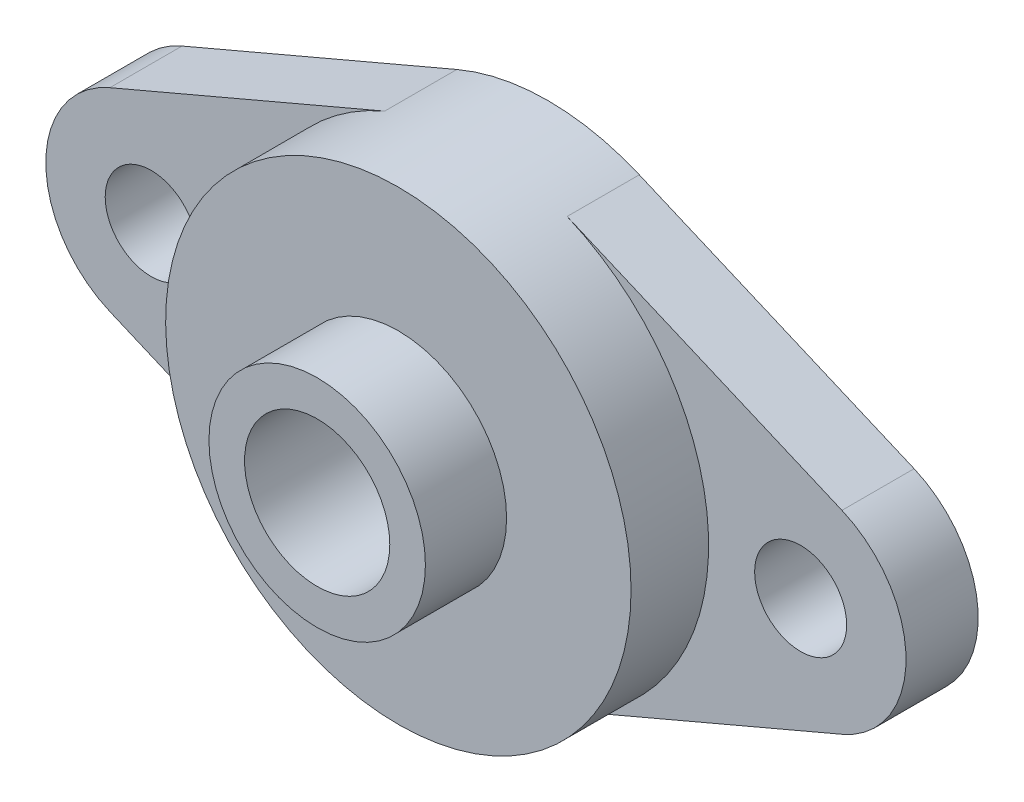
ISO-10303-21;
HEADER;
FILE_DESCRIPTION(('STEP AP214'),'2;1');
FILE_NAME('part.step','',(''),(''),'','','');
FILE_SCHEMA(('AUTOMOTIVE_DESIGN { 1 0 10303 214 1 1 1 1 }'));
ENDSEC;
DATA;
#1=APPLICATION_CONTEXT('core data for automotive mechanical design processes');
#2=APPLICATION_PROTOCOL_DEFINITION('international standard','automotive_design',2000,#1);
#3=PRODUCT_CONTEXT('',#1,'mechanical');
#4=PRODUCT('Part','Part','',(#3));
#5=PRODUCT_RELATED_PRODUCT_CATEGORY('part','',(#4));
#6=PRODUCT_DEFINITION_FORMATION('','',#4);
#7=PRODUCT_DEFINITION_CONTEXT('part definition',#1,'design');
#8=PRODUCT_DEFINITION('design','',#6,#7);
#9=PRODUCT_DEFINITION_SHAPE('','',#8);
#10=(LENGTH_UNIT() NAMED_UNIT(*) SI_UNIT(.MILLI.,.METRE.));
#11=(NAMED_UNIT(*) PLANE_ANGLE_UNIT() SI_UNIT($,.RADIAN.));
#12=(NAMED_UNIT(*) SI_UNIT($,.STERADIAN.) SOLID_ANGLE_UNIT());
#13=UNCERTAINTY_MEASURE_WITH_UNIT(LENGTH_MEASURE(1.E-05),#10,'distance_accuracy_value','');
#14=(GEOMETRIC_REPRESENTATION_CONTEXT(3) GLOBAL_UNCERTAINTY_ASSIGNED_CONTEXT((#13)) GLOBAL_UNIT_ASSIGNED_CONTEXT((#10,
#11,#12)) REPRESENTATION_CONTEXT('',''));
#15=CARTESIAN_POINT('',(0.,0.,0.));
#16=DIRECTION('',(0.,0.,1.));
#17=DIRECTION('',(1.,0.,0.));
#18=AXIS2_PLACEMENT_3D('',#15,#16,#17);
#19=CARTESIAN_POINT('',(0.,0.,8.3));
#20=DIRECTION('',(0.,0.,-1.));
#21=DIRECTION('',(-1.,0.,0.));
#22=AXIS2_PLACEMENT_3D('',#19,#20,#21);
#23=CYLINDRICAL_SURFACE('',#22,12.9);
#24=CARTESIAN_POINT('',(0.,0.,4.));
#25=DIRECTION('',(0.,0.,1.));
#26=DIRECTION('',(1.,0.,0.));
#27=AXIS2_PLACEMENT_3D('',#24,#25,#26);
#28=CIRCLE('',#27,12.9);
#29=CARTESIAN_POINT('',(5.05734354907398,-11.8673196732303,4.));
#30=VERTEX_POINT('',#29);
#31=CARTESIAN_POINT('',(5.05734354907397,11.8673196732303,4.));
#32=VERTEX_POINT('',#31);
#33=EDGE_CURVE('E177',#30,#32,#28,.T.);
#34=ORIENTED_EDGE('',*,*,#33,.T.);
#35=DIRECTION('',(0.,0.,-1.));
#36=VECTOR('',#35,1.);
#37=CARTESIAN_POINT('',(5.05734354907398,11.8673196732303,4.));
#38=LINE('',#37,#36);
#39=CARTESIAN_POINT('',(5.05734354907398,11.8673196732303,0.));
#40=VERTEX_POINT('',#39);
#41=EDGE_CURVE('E119',#32,#40,#38,.T.);
#42=ORIENTED_EDGE('',*,*,#41,.T.);
#43=CARTESIAN_POINT('',(0.,0.,0.));
#44=DIRECTION('',(0.,0.,1.));
#45=DIRECTION('',(1.,0.,0.));
#46=AXIS2_PLACEMENT_3D('',#43,#44,#45);
#47=CIRCLE('',#46,12.9);
#48=CARTESIAN_POINT('',(-5.05734354907397,11.8673196732303,0.));
#49=VERTEX_POINT('',#48);
#50=EDGE_CURVE('E209',#40,#49,#47,.T.);
#51=ORIENTED_EDGE('',*,*,#50,.T.);
#52=DIRECTION('',(0.,0.,-1.));
#53=VECTOR('',#52,1.);
#54=CARTESIAN_POINT('',(-5.05734354907397,11.8673196732303,4.));
#55=LINE('',#54,#53);
#56=CARTESIAN_POINT('',(-5.05734354907397,11.8673196732303,4.));
#57=VERTEX_POINT('',#56);
#58=EDGE_CURVE('E58',#57,#49,#55,.T.);
#59=ORIENTED_EDGE('',*,*,#58,.F.);
#60=CARTESIAN_POINT('',(-5.05734354907398,-11.8673196732303,4.));
#61=VERTEX_POINT('',#60);
#62=EDGE_CURVE('E62',#57,#61,#28,.T.);
#63=ORIENTED_EDGE('',*,*,#62,.T.);
#64=DIRECTION('',(0.,0.,-1.));
#65=VECTOR('',#64,1.);
#66=CARTESIAN_POINT('',(-5.05734354907397,-11.8673196732303,4.));
#67=LINE('',#66,#65);
#68=CARTESIAN_POINT('',(-5.05734354907397,-11.8673196732303,0.));
#69=VERTEX_POINT('',#68);
#70=EDGE_CURVE('E184',#61,#69,#67,.T.);
#71=ORIENTED_EDGE('',*,*,#70,.T.);
#72=CARTESIAN_POINT('',(5.05734354907398,-11.8673196732303,0.));
#73=VERTEX_POINT('',#72);
#74=EDGE_CURVE('E204',#69,#73,#47,.T.);
#75=ORIENTED_EDGE('',*,*,#74,.T.);
#76=DIRECTION('',(0.,0.,-1.));
#77=VECTOR('',#76,1.);
#78=CARTESIAN_POINT('',(5.05734354907397,-11.8673196732303,4.));
#79=LINE('',#78,#77);
#80=EDGE_CURVE('E187',#30,#73,#79,.T.);
#81=ORIENTED_EDGE('',*,*,#80,.F.);
#82=EDGE_LOOP('',(#34,#42,#51,#59,#63,#71,#75,#81));
#83=FACE_BOUND('',#82,.T.);
#84=CARTESIAN_POINT('',(0.,0.,8.3));
#85=DIRECTION('',(0.,0.,1.));
#86=DIRECTION('',(1.,0.,0.));
#87=AXIS2_PLACEMENT_3D('',#84,#85,#86);
#88=CIRCLE('',#87,12.9);
#89=CARTESIAN_POINT('',(12.9,0.,8.3));
#90=VERTEX_POINT('',#89);
#91=EDGE_CURVE('E50',#90,#90,#88,.T.);
#92=ORIENTED_EDGE('',*,*,#91,.F.);
#93=EDGE_LOOP('',(#92));
#94=FACE_BOUND('',#93,.T.);
#95=ADVANCED_FACE('F41',(#83,#94),#23,.T.);
#96=CARTESIAN_POINT('',(0.,0.,8.3));
#97=DIRECTION('',(0.,0.,1.));
#98=DIRECTION('',(1.,0.,0.));
#99=AXIS2_PLACEMENT_3D('',#96,#97,#98);
#100=PLANE('',#99);
#101=CARTESIAN_POINT('',(0.,0.,8.3));
#102=DIRECTION('',(0.,0.,1.));
#103=DIRECTION('',(1.,0.,0.));
#104=AXIS2_PLACEMENT_3D('',#101,#102,#103);
#105=CIRCLE('',#104,6.);
#106=CARTESIAN_POINT('',(6.,0.,8.3));
#107=VERTEX_POINT('',#106);
#108=EDGE_CURVE('E11',#107,#107,#105,.T.);
#109=ORIENTED_EDGE('',*,*,#108,.F.);
#110=EDGE_LOOP('',(#109));
#111=FACE_BOUND('',#110,.T.);
#112=ORIENTED_EDGE('',*,*,#91,.T.);
#113=EDGE_LOOP('',(#112));
#114=FACE_BOUND('',#113,.T.);
#115=ADVANCED_FACE('F237',(#111,#114),#100,.T.);
#116=CARTESIAN_POINT('',(0.,0.,0.));
#117=DIRECTION('',(0.,0.,1.));
#118=DIRECTION('',(1.,0.,0.));
#119=AXIS2_PLACEMENT_3D('',#116,#117,#118);
#120=PLANE('',#119);
#121=CARTESIAN_POINT('',(0.,0.,0.));
#122=DIRECTION('',(0.,0.,-1.));
#123=DIRECTION('',(-1.,0.,0.));
#124=AXIS2_PLACEMENT_3D('',#121,#122,#123);
#125=CIRCLE('',#124,4.025);
#126=CARTESIAN_POINT('',(-4.025,0.,0.));
#127=VERTEX_POINT('',#126);
#128=EDGE_CURVE('E225',#127,#127,#125,.T.);
#129=ORIENTED_EDGE('',*,*,#128,.F.);
#130=EDGE_LOOP('',(#129));
#131=FACE_BOUND('',#130,.T.);
#132=CARTESIAN_POINT('',(-18.,0.,0.));
#133=DIRECTION('',(0.,0.,-1.));
#134=DIRECTION('',(-1.,0.,0.));
#135=AXIS2_PLACEMENT_3D('',#132,#133,#134);
#136=CIRCLE('',#135,2.55);
#137=CARTESIAN_POINT('',(-20.55,0.,0.));
#138=VERTEX_POINT('',#137);
#139=EDGE_CURVE('E214',#138,#138,#136,.T.);
#140=ORIENTED_EDGE('',*,*,#139,.F.);
#141=EDGE_LOOP('',(#140));
#142=FACE_BOUND('',#141,.T.);
#143=CARTESIAN_POINT('',(18.,0.,0.));
#144=DIRECTION('',(0.,0.,-1.));
#145=DIRECTION('',(-1.,0.,0.));
#146=AXIS2_PLACEMENT_3D('',#143,#144,#145);
#147=CIRCLE('',#146,2.55);
#148=CARTESIAN_POINT('',(15.45,0.,0.));
#149=VERTEX_POINT('',#148);
#150=EDGE_CURVE('E142',#149,#149,#147,.T.);
#151=ORIENTED_EDGE('',*,*,#150,.F.);
#152=EDGE_LOOP('',(#151));
#153=FACE_BOUND('',#152,.T.);
#154=ORIENTED_EDGE('',*,*,#50,.F.);
#155=DIRECTION('',(0.919947261490724,-0.39204213558713,0.));
#156=VECTOR('',#155,1.);
#157=CARTESIAN_POINT('',(5.05734354907398,11.8673196732303,0.));
#158=LINE('',#157,#156);
#159=CARTESIAN_POINT('',(20.2907968997111,5.37547407082794,0.));
#160=VERTEX_POINT('',#159);
#161=EDGE_CURVE('E159',#40,#160,#158,.T.);
#162=ORIENTED_EDGE('',*,*,#161,.T.);
#163=CARTESIAN_POINT('',(18.,0.,0.));
#164=DIRECTION('',(0.,0.,-1.));
#165=DIRECTION('',(-1.,0.,0.));
#166=AXIS2_PLACEMENT_3D('',#163,#164,#165);
#167=CIRCLE('',#166,5.84324155943166);
#168=CARTESIAN_POINT('',(20.2907968997111,-5.37547407082794,0.));
#169=VERTEX_POINT('',#168);
#170=EDGE_CURVE('E112',#160,#169,#167,.T.);
#171=ORIENTED_EDGE('',*,*,#170,.T.);
#172=DIRECTION('',(-0.919947261490724,-0.39204213558713,0.));
#173=VECTOR('',#172,1.);
#174=CARTESIAN_POINT('',(20.2907968997111,-5.37547407082794,0.));
#175=LINE('',#174,#173);
#176=EDGE_CURVE('E164',#169,#73,#175,.T.);
#177=ORIENTED_EDGE('',*,*,#176,.T.);
#178=ORIENTED_EDGE('',*,*,#74,.F.);
#179=DIRECTION('',(-0.919947261490724,0.392042135587131,0.));
#180=VECTOR('',#179,1.);
#181=CARTESIAN_POINT('',(-20.2907968997111,-5.37547407082793,0.));
#182=LINE('',#181,#180);
#183=CARTESIAN_POINT('',(-20.2907968997111,-5.37547407082793,0.));
#184=VERTEX_POINT('',#183);
#185=EDGE_CURVE('E168',#69,#184,#182,.T.);
#186=ORIENTED_EDGE('',*,*,#185,.T.);
#187=CARTESIAN_POINT('',(-18.,0.,0.));
#188=DIRECTION('',(0.,0.,-1.));
#189=DIRECTION('',(1.,0.,0.));
#190=AXIS2_PLACEMENT_3D('',#187,#188,#189);
#191=CIRCLE('',#190,5.84324155943166);
#192=CARTESIAN_POINT('',(-20.2907968997111,5.37547407082795,0.));
#193=VERTEX_POINT('',#192);
#194=EDGE_CURVE('E139',#184,#193,#191,.T.);
#195=ORIENTED_EDGE('',*,*,#194,.T.);
#196=DIRECTION('',(0.919947261490724,0.39204213558713,0.));
#197=VECTOR('',#196,1.);
#198=CARTESIAN_POINT('',(-5.05734354907397,11.8673196732303,0.));
#199=LINE('',#198,#197);
#200=EDGE_CURVE('E135',#193,#49,#199,.T.);
#201=ORIENTED_EDGE('',*,*,#200,.T.);
#202=EDGE_LOOP('',(#154,#162,#171,#177,#178,#186,#195,#201));
#203=FACE_BOUND('',#202,.T.);
#204=ADVANCED_FACE('F233',(#131,#142,#153,#203),#120,.F.);
#205=CARTESIAN_POINT('',(0.,0.,12.8));
#206=DIRECTION('',(0.,0.,-1.));
#207=DIRECTION('',(-1.,0.,0.));
#208=AXIS2_PLACEMENT_3D('',#205,#206,#207);
#209=CYLINDRICAL_SURFACE('',#208,6.);
#210=CARTESIAN_POINT('',(0.,0.,12.8));
#211=DIRECTION('',(0.,0.,1.));
#212=DIRECTION('',(1.,0.,0.));
#213=AXIS2_PLACEMENT_3D('',#210,#211,#212);
#214=CIRCLE('',#213,6.);
#215=CARTESIAN_POINT('',(6.,0.,12.8));
#216=VERTEX_POINT('',#215);
#217=EDGE_CURVE('E201',#216,#216,#214,.T.);
#218=ORIENTED_EDGE('',*,*,#217,.F.);
#219=EDGE_LOOP('',(#218));
#220=FACE_BOUND('',#219,.T.);
#221=ORIENTED_EDGE('',*,*,#108,.T.);
#222=EDGE_LOOP('',(#221));
#223=FACE_BOUND('',#222,.T.);
#224=ADVANCED_FACE('F236',(#220,#223),#209,.T.);
#225=CARTESIAN_POINT('',(0.,0.,12.8));
#226=DIRECTION('',(0.,0.,1.));
#227=DIRECTION('',(1.,0.,0.));
#228=AXIS2_PLACEMENT_3D('',#225,#226,#227);
#229=PLANE('',#228);
#230=CARTESIAN_POINT('',(0.,0.,12.8));
#231=DIRECTION('',(0.,0.,1.));
#232=DIRECTION('',(1.,0.,0.));
#233=AXIS2_PLACEMENT_3D('',#230,#231,#232);
#234=CIRCLE('',#233,4.025);
#235=CARTESIAN_POINT('',(4.025,0.,12.8));
#236=VERTEX_POINT('',#235);
#237=EDGE_CURVE('E197',#236,#236,#234,.T.);
#238=ORIENTED_EDGE('',*,*,#237,.F.);
#239=EDGE_LOOP('',(#238));
#240=FACE_BOUND('',#239,.T.);
#241=ORIENTED_EDGE('',*,*,#217,.T.);
#242=EDGE_LOOP('',(#241));
#243=FACE_BOUND('',#242,.T.);
#244=ADVANCED_FACE('F286',(#240,#243),#229,.T.);
#245=CARTESIAN_POINT('',(0.,0.,-12.2));
#246=DIRECTION('',(0.,0.,1.));
#247=DIRECTION('',(1.,0.,0.));
#248=AXIS2_PLACEMENT_3D('',#245,#246,#247);
#249=CYLINDRICAL_SURFACE('',#248,4.025);
#250=ORIENTED_EDGE('',*,*,#237,.T.);
#251=EDGE_LOOP('',(#250));
#252=FACE_BOUND('',#251,.T.);
#253=ORIENTED_EDGE('',*,*,#128,.T.);
#254=EDGE_LOOP('',(#253));
#255=FACE_BOUND('',#254,.T.);
#256=ADVANCED_FACE('F231',(#252,#255),#249,.F.);
#257=CARTESIAN_POINT('',(18.,0.,4.));
#258=DIRECTION('',(0.,0.,-1.));
#259=DIRECTION('',(-1.,0.,0.));
#260=AXIS2_PLACEMENT_3D('',#257,#258,#259);
#261=CYLINDRICAL_SURFACE('',#260,5.84324155943166);
#262=ORIENTED_EDGE('',*,*,#170,.F.);
#263=DIRECTION('',(0.,0.,-1.));
#264=VECTOR('',#263,1.);
#265=CARTESIAN_POINT('',(20.2907968997111,5.37547407082794,4.));
#266=LINE('',#265,#264);
#267=CARTESIAN_POINT('',(20.2907968997111,5.37547407082794,4.));
#268=VERTEX_POINT('',#267);
#269=EDGE_CURVE('E107',#268,#160,#266,.T.);
#270=ORIENTED_EDGE('',*,*,#269,.F.);
#271=CARTESIAN_POINT('',(18.,0.,4.));
#272=DIRECTION('',(0.,0.,-1.));
#273=DIRECTION('',(-1.,0.,0.));
#274=AXIS2_PLACEMENT_3D('',#271,#272,#273);
#275=CIRCLE('',#274,5.84324155943166);
#276=CARTESIAN_POINT('',(20.2907968997111,-5.37547407082794,4.));
#277=VERTEX_POINT('',#276);
#278=EDGE_CURVE('E110',#268,#277,#275,.T.);
#279=ORIENTED_EDGE('',*,*,#278,.T.);
#280=DIRECTION('',(0.,0.,-1.));
#281=VECTOR('',#280,1.);
#282=CARTESIAN_POINT('',(20.2907968997111,-5.37547407082794,4.));
#283=LINE('',#282,#281);
#284=EDGE_CURVE('E118',#277,#169,#283,.T.);
#285=ORIENTED_EDGE('',*,*,#284,.T.);
#286=EDGE_LOOP('',(#262,#270,#279,#285));
#287=FACE_BOUND('',#286,.T.);
#288=ADVANCED_FACE('F109',(#287),#261,.T.);
#289=CARTESIAN_POINT('',(0.,0.,4.));
#290=DIRECTION('',(0.,0.,1.));
#291=DIRECTION('',(1.,0.,0.));
#292=AXIS2_PLACEMENT_3D('',#289,#290,#291);
#293=PLANE('',#292);
#294=CARTESIAN_POINT('',(18.,0.,4.));
#295=DIRECTION('',(0.,0.,1.));
#296=DIRECTION('',(1.,0.,0.));
#297=AXIS2_PLACEMENT_3D('',#294,#295,#296);
#298=CIRCLE('',#297,2.55);
#299=CARTESIAN_POINT('',(20.55,0.,4.));
#300=VERTEX_POINT('',#299);
#301=EDGE_CURVE('E44',#300,#300,#298,.T.);
#302=ORIENTED_EDGE('',*,*,#301,.F.);
#303=EDGE_LOOP('',(#302));
#304=FACE_BOUND('',#303,.T.);
#305=ORIENTED_EDGE('',*,*,#33,.F.);
#306=DIRECTION('',(-0.919947261490724,-0.39204213558713,0.));
#307=VECTOR('',#306,1.);
#308=CARTESIAN_POINT('',(20.2907968997111,-5.37547407082794,4.));
#309=LINE('',#308,#307);
#310=EDGE_CURVE('E128',#277,#30,#309,.T.);
#311=ORIENTED_EDGE('',*,*,#310,.F.);
#312=ORIENTED_EDGE('',*,*,#278,.F.);
#313=DIRECTION('',(0.919947261490724,-0.39204213558713,0.));
#314=VECTOR('',#313,1.);
#315=CARTESIAN_POINT('',(5.05734354907398,11.8673196732303,4.));
#316=LINE('',#315,#314);
#317=EDGE_CURVE('E126',#32,#268,#316,.T.);
#318=ORIENTED_EDGE('',*,*,#317,.F.);
#319=EDGE_LOOP('',(#305,#311,#312,#318));
#320=FACE_BOUND('',#319,.T.);
#321=ADVANCED_FACE('F125',(#304,#320),#293,.T.);
#322=CARTESIAN_POINT('',(5.05734354907398,11.8673196732303,4.));
#323=DIRECTION('',(0.39204213558713,0.919947261490724,0.));
#324=DIRECTION('',(-0.919947261490724,0.39204213558713,0.));
#325=AXIS2_PLACEMENT_3D('',#322,#323,#324);
#326=PLANE('',#325);
#327=ORIENTED_EDGE('',*,*,#161,.F.);
#328=ORIENTED_EDGE('',*,*,#41,.F.);
#329=ORIENTED_EDGE('',*,*,#317,.T.);
#330=ORIENTED_EDGE('',*,*,#269,.T.);
#331=EDGE_LOOP('',(#327,#328,#329,#330));
#332=FACE_BOUND('',#331,.T.);
#333=ADVANCED_FACE('F132',(#332),#326,.T.);
#334=CARTESIAN_POINT('',(20.2907968997111,-5.37547407082794,4.));
#335=DIRECTION('',(0.39204213558713,-0.919947261490724,0.));
#336=DIRECTION('',(0.919947261490724,0.39204213558713,0.));
#337=AXIS2_PLACEMENT_3D('',#334,#335,#336);
#338=PLANE('',#337);
#339=ORIENTED_EDGE('',*,*,#176,.F.);
#340=ORIENTED_EDGE('',*,*,#284,.F.);
#341=ORIENTED_EDGE('',*,*,#310,.T.);
#342=ORIENTED_EDGE('',*,*,#80,.T.);
#343=EDGE_LOOP('',(#339,#340,#341,#342));
#344=FACE_BOUND('',#343,.T.);
#345=ADVANCED_FACE('F245',(#344),#338,.T.);
#346=CARTESIAN_POINT('',(-18.,0.,4.));
#347=DIRECTION('',(0.,0.,1.));
#348=DIRECTION('',(1.,0.,0.));
#349=AXIS2_PLACEMENT_3D('',#346,#347,#348);
#350=CIRCLE('',#349,2.55);
#351=CARTESIAN_POINT('',(-15.45,0.,4.));
#352=VERTEX_POINT('',#351);
#353=EDGE_CURVE('E211',#352,#352,#350,.T.);
#354=ORIENTED_EDGE('',*,*,#353,.F.);
#355=EDGE_LOOP('',(#354));
#356=FACE_BOUND('',#355,.T.);
#357=ORIENTED_EDGE('',*,*,#62,.F.);
#358=DIRECTION('',(0.919947261490724,0.39204213558713,0.));
#359=VECTOR('',#358,1.);
#360=CARTESIAN_POINT('',(-5.05734354907397,11.8673196732303,4.));
#361=LINE('',#360,#359);
#362=CARTESIAN_POINT('',(-20.2907968997111,5.37547407082795,4.));
#363=VERTEX_POINT('',#362);
#364=EDGE_CURVE('E155',#363,#57,#361,.T.);
#365=ORIENTED_EDGE('',*,*,#364,.F.);
#366=CARTESIAN_POINT('',(-18.,0.,4.));
#367=DIRECTION('',(0.,0.,-1.));
#368=DIRECTION('',(1.,0.,0.));
#369=AXIS2_PLACEMENT_3D('',#366,#367,#368);
#370=CIRCLE('',#369,5.84324155943166);
#371=CARTESIAN_POINT('',(-20.2907968997111,-5.37547407082793,4.));
#372=VERTEX_POINT('',#371);
#373=EDGE_CURVE('E151',#372,#363,#370,.T.);
#374=ORIENTED_EDGE('',*,*,#373,.F.);
#375=DIRECTION('',(-0.919947261490724,0.392042135587131,0.));
#376=VECTOR('',#375,1.);
#377=CARTESIAN_POINT('',(-20.2907968997111,-5.37547407082793,4.));
#378=LINE('',#377,#376);
#379=EDGE_CURVE('E147',#61,#372,#378,.T.);
#380=ORIENTED_EDGE('',*,*,#379,.F.);
#381=EDGE_LOOP('',(#357,#365,#374,#380));
#382=FACE_BOUND('',#381,.T.);
#383=ADVANCED_FACE('F259',(#356,#382),#293,.T.);
#384=CARTESIAN_POINT('',(-5.05734354907397,11.8673196732303,4.));
#385=DIRECTION('',(-0.39204213558713,0.919947261490724,0.));
#386=DIRECTION('',(-0.919947261490724,-0.39204213558713,0.));
#387=AXIS2_PLACEMENT_3D('',#384,#385,#386);
#388=PLANE('',#387);
#389=ORIENTED_EDGE('',*,*,#200,.F.);
#390=DIRECTION('',(0.,0.,-1.));
#391=VECTOR('',#390,1.);
#392=CARTESIAN_POINT('',(-20.2907968997111,5.37547407082795,4.));
#393=LINE('',#392,#391);
#394=EDGE_CURVE('E178',#363,#193,#393,.T.);
#395=ORIENTED_EDGE('',*,*,#394,.F.);
#396=ORIENTED_EDGE('',*,*,#364,.T.);
#397=ORIENTED_EDGE('',*,*,#58,.T.);
#398=EDGE_LOOP('',(#389,#395,#396,#397));
#399=FACE_BOUND('',#398,.T.);
#400=ADVANCED_FACE('F256',(#399),#388,.T.);
#401=CARTESIAN_POINT('',(-18.,0.,4.));
#402=DIRECTION('',(0.,0.,-1.));
#403=DIRECTION('',(-1.,0.,0.));
#404=AXIS2_PLACEMENT_3D('',#401,#402,#403);
#405=CYLINDRICAL_SURFACE('',#404,5.84324155943166);
#406=ORIENTED_EDGE('',*,*,#194,.F.);
#407=DIRECTION('',(0.,0.,-1.));
#408=VECTOR('',#407,1.);
#409=CARTESIAN_POINT('',(-20.2907968997111,-5.37547407082793,4.));
#410=LINE('',#409,#408);
#411=EDGE_CURVE('E181',#372,#184,#410,.T.);
#412=ORIENTED_EDGE('',*,*,#411,.F.);
#413=ORIENTED_EDGE('',*,*,#373,.T.);
#414=ORIENTED_EDGE('',*,*,#394,.T.);
#415=EDGE_LOOP('',(#406,#412,#413,#414));
#416=FACE_BOUND('',#415,.T.);
#417=ADVANCED_FACE('F254',(#416),#405,.T.);
#418=CARTESIAN_POINT('',(-20.2907968997111,-5.37547407082793,4.));
#419=DIRECTION('',(-0.39204213558713,-0.919947261490724,0.));
#420=DIRECTION('',(0.919947261490724,-0.39204213558713,0.));
#421=AXIS2_PLACEMENT_3D('',#418,#419,#420);
#422=PLANE('',#421);
#423=ORIENTED_EDGE('',*,*,#185,.F.);
#424=ORIENTED_EDGE('',*,*,#70,.F.);
#425=ORIENTED_EDGE('',*,*,#379,.T.);
#426=ORIENTED_EDGE('',*,*,#411,.T.);
#427=EDGE_LOOP('',(#423,#424,#425,#426));
#428=FACE_BOUND('',#427,.T.);
#429=ADVANCED_FACE('F250',(#428),#422,.T.);
#430=CARTESIAN_POINT('',(-18.,0.,12.8));
#431=DIRECTION('',(0.,0.,-1.));
#432=DIRECTION('',(-1.,0.,0.));
#433=AXIS2_PLACEMENT_3D('',#430,#431,#432);
#434=CYLINDRICAL_SURFACE('',#433,2.55);
#435=ORIENTED_EDGE('',*,*,#353,.T.);
#436=EDGE_LOOP('',(#435));
#437=FACE_BOUND('',#436,.T.);
#438=ORIENTED_EDGE('',*,*,#139,.T.);
#439=EDGE_LOOP('',(#438));
#440=FACE_BOUND('',#439,.T.);
#441=ADVANCED_FACE('F300',(#437,#440),#434,.F.);
#442=CARTESIAN_POINT('',(18.,0.,12.8));
#443=DIRECTION('',(0.,0.,-1.));
#444=DIRECTION('',(-1.,0.,0.));
#445=AXIS2_PLACEMENT_3D('',#442,#443,#444);
#446=CYLINDRICAL_SURFACE('',#445,2.55);
#447=ORIENTED_EDGE('',*,*,#301,.T.);
#448=EDGE_LOOP('',(#447));
#449=FACE_BOUND('',#448,.T.);
#450=ORIENTED_EDGE('',*,*,#150,.T.);
#451=EDGE_LOOP('',(#450));
#452=FACE_BOUND('',#451,.T.);
#453=ADVANCED_FACE('F317',(#449,#452),#446,.F.);
#454=CLOSED_SHELL('',(#95,#115,#204,#224,#244,#256,#288,#321,#333,#345,#383,#400,#417,#429,#441,#453));
#455=MANIFOLD_SOLID_BREP('B2',#454);
#456=ADVANCED_BREP_SHAPE_REPRESENTATION('',(#18,#455),#14);
#457=SHAPE_DEFINITION_REPRESENTATION(#9,#456);
ENDSEC;
END-ISO-10303-21;
